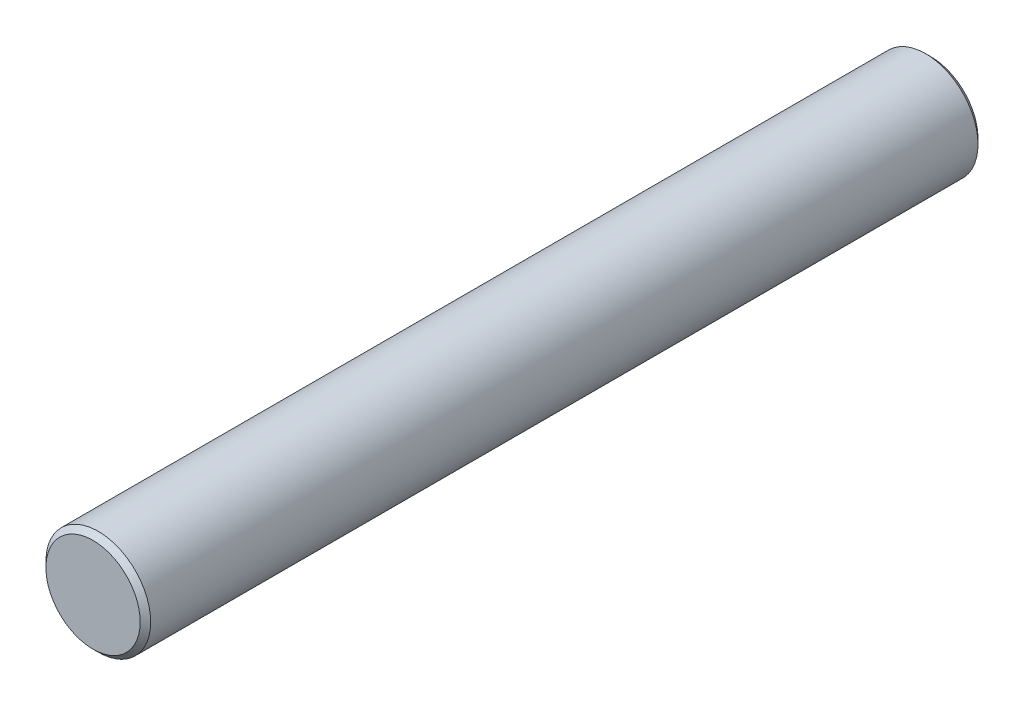
ISO-10303-21;
HEADER;
FILE_DESCRIPTION(('STEP AP214'),'2;1');
FILE_NAME('part.step','',(''),(''),'','','');
FILE_SCHEMA(('AUTOMOTIVE_DESIGN { 1 0 10303 214 1 1 1 1 }'));
ENDSEC;
DATA;
#1=APPLICATION_CONTEXT('core data for automotive mechanical design processes');
#2=APPLICATION_PROTOCOL_DEFINITION('international standard','automotive_design',2000,#1);
#3=PRODUCT_CONTEXT('',#1,'mechanical');
#4=PRODUCT('Part','Part','',(#3));
#5=PRODUCT_RELATED_PRODUCT_CATEGORY('part','',(#4));
#6=PRODUCT_DEFINITION_FORMATION('','',#4);
#7=PRODUCT_DEFINITION_CONTEXT('part definition',#1,'design');
#8=PRODUCT_DEFINITION('design','',#6,#7);
#9=PRODUCT_DEFINITION_SHAPE('','',#8);
#10=(LENGTH_UNIT() NAMED_UNIT(*) SI_UNIT(.MILLI.,.METRE.));
#11=(NAMED_UNIT(*) PLANE_ANGLE_UNIT() SI_UNIT($,.RADIAN.));
#12=(NAMED_UNIT(*) SI_UNIT($,.STERADIAN.) SOLID_ANGLE_UNIT());
#13=UNCERTAINTY_MEASURE_WITH_UNIT(LENGTH_MEASURE(1.E-05),#10,'distance_accuracy_value','');
#14=(GEOMETRIC_REPRESENTATION_CONTEXT(3) GLOBAL_UNCERTAINTY_ASSIGNED_CONTEXT((#13)) GLOBAL_UNIT_ASSIGNED_CONTEXT((#10,
#11,#12)) REPRESENTATION_CONTEXT('',''));
#15=CARTESIAN_POINT('',(0.,0.,0.));
#16=DIRECTION('',(0.,0.,1.));
#17=DIRECTION('',(1.,0.,0.));
#18=AXIS2_PLACEMENT_3D('',#15,#16,#17);
#19=CARTESIAN_POINT('',(0.,0.,40.));
#20=DIRECTION('',(0.,0.,-1.));
#21=DIRECTION('',(-1.,0.,0.));
#22=AXIS2_PLACEMENT_3D('',#19,#20,#21);
#23=CYLINDRICAL_SURFACE('',#22,2.5);
#24=CARTESIAN_POINT('',(0.,0.,0.25));
#25=DIRECTION('',(0.,0.,1.));
#26=DIRECTION('',(1.,0.,0.));
#27=AXIS2_PLACEMENT_3D('',#24,#25,#26);
#28=CIRCLE('',#27,2.5);
#29=CARTESIAN_POINT('',(2.5,0.,0.25));
#30=VERTEX_POINT('',#29);
#31=EDGE_CURVE('E39',#30,#30,#28,.T.);
#32=ORIENTED_EDGE('',*,*,#31,.T.);
#33=EDGE_LOOP('',(#32));
#34=FACE_BOUND('',#33,.T.);
#35=CARTESIAN_POINT('',(0.,0.,39.75));
#36=DIRECTION('',(0.,0.,1.));
#37=DIRECTION('',(1.,0.,0.));
#38=AXIS2_PLACEMENT_3D('',#35,#36,#37);
#39=CIRCLE('',#38,2.5);
#40=CARTESIAN_POINT('',(2.5,0.,39.75));
#41=VERTEX_POINT('',#40);
#42=EDGE_CURVE('E43',#41,#41,#39,.F.);
#43=ORIENTED_EDGE('',*,*,#42,.T.);
#44=EDGE_LOOP('',(#43));
#45=FACE_BOUND('',#44,.T.);
#46=ADVANCED_FACE('F29',(#34,#45),#23,.T.);
#47=CARTESIAN_POINT('',(0.,0.,40.));
#48=DIRECTION('',(0.,0.,1.));
#49=DIRECTION('',(1.,0.,0.));
#50=AXIS2_PLACEMENT_3D('',#47,#48,#49);
#51=PLANE('',#50);
#52=CARTESIAN_POINT('',(0.,0.,40.));
#53=DIRECTION('',(0.,0.,1.));
#54=DIRECTION('',(1.,0.,0.));
#55=AXIS2_PLACEMENT_3D('',#52,#53,#54);
#56=CIRCLE('',#55,2.25);
#57=CARTESIAN_POINT('',(2.25,0.,40.));
#58=VERTEX_POINT('',#57);
#59=EDGE_CURVE('E10',#58,#58,#56,.T.);
#60=ORIENTED_EDGE('',*,*,#59,.T.);
#61=EDGE_LOOP('',(#60));
#62=FACE_BOUND('',#61,.T.);
#63=ADVANCED_FACE('F62',(#62),#51,.T.);
#64=CARTESIAN_POINT('',(0.,0.,0.));
#65=DIRECTION('',(0.,0.,1.));
#66=DIRECTION('',(1.,0.,0.));
#67=AXIS2_PLACEMENT_3D('',#64,#65,#66);
#68=PLANE('',#67);
#69=CARTESIAN_POINT('',(0.,0.,0.));
#70=DIRECTION('',(0.,0.,1.));
#71=DIRECTION('',(1.,0.,0.));
#72=AXIS2_PLACEMENT_3D('',#69,#70,#71);
#73=CIRCLE('',#72,2.25);
#74=CARTESIAN_POINT('',(2.25,0.,0.));
#75=VERTEX_POINT('',#74);
#76=EDGE_CURVE('E35',#75,#75,#73,.F.);
#77=ORIENTED_EDGE('',*,*,#76,.T.);
#78=EDGE_LOOP('',(#77));
#79=FACE_BOUND('',#78,.T.);
#80=ADVANCED_FACE('F58',(#79),#68,.F.);
#81=CARTESIAN_POINT('',(0.,0.,0.25));
#82=DIRECTION('',(0.,0.,1.));
#83=DIRECTION('',(1.,0.,0.));
#84=AXIS2_PLACEMENT_3D('',#81,#82,#83);
#85=CONICAL_SURFACE('',#84,2.5,0.785398163397457);
#86=ORIENTED_EDGE('',*,*,#76,.F.);
#87=EDGE_LOOP('',(#86));
#88=FACE_BOUND('',#87,.T.);
#89=ORIENTED_EDGE('',*,*,#31,.F.);
#90=EDGE_LOOP('',(#89));
#91=FACE_BOUND('',#90,.T.);
#92=ADVANCED_FACE('F53',(#88,#91),#85,.T.);
#93=CARTESIAN_POINT('',(0.,0.,40.));
#94=DIRECTION('',(0.,0.,-1.));
#95=DIRECTION('',(-1.,0.,0.));
#96=AXIS2_PLACEMENT_3D('',#93,#94,#95);
#97=CONICAL_SURFACE('',#96,2.25,0.785398163397457);
#98=ORIENTED_EDGE('',*,*,#42,.F.);
#99=EDGE_LOOP('',(#98));
#100=FACE_BOUND('',#99,.T.);
#101=ORIENTED_EDGE('',*,*,#59,.F.);
#102=EDGE_LOOP('',(#101));
#103=FACE_BOUND('',#102,.T.);
#104=ADVANCED_FACE('F50',(#100,#103),#97,.T.);
#105=CLOSED_SHELL('',(#46,#63,#80,#92,#104));
#106=MANIFOLD_SOLID_BREP('B2',#105);
#107=ADVANCED_BREP_SHAPE_REPRESENTATION('',(#18,#106),#14);
#108=SHAPE_DEFINITION_REPRESENTATION(#9,#107);
ENDSEC;
END-ISO-10303-21;
